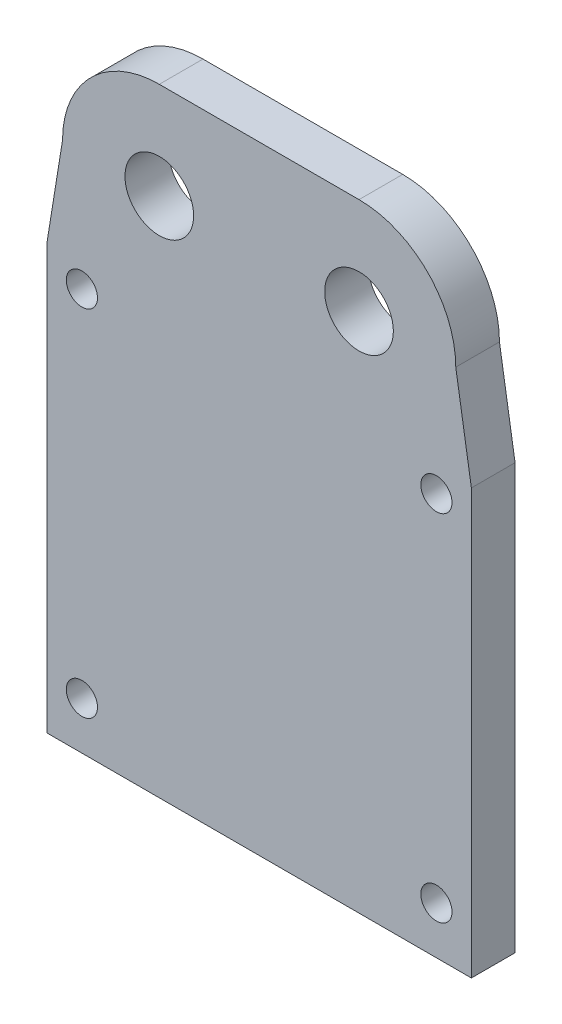
ISO-10303-21;
HEADER;
FILE_DESCRIPTION(('STEP AP214'),'2;1');
FILE_NAME('part.step','',(''),(''),'','','');
FILE_SCHEMA(('AUTOMOTIVE_DESIGN { 1 0 10303 214 1 1 1 1 }'));
ENDSEC;
DATA;
#1=APPLICATION_CONTEXT('core data for automotive mechanical design processes');
#2=APPLICATION_PROTOCOL_DEFINITION('international standard','automotive_design',2000,#1);
#3=PRODUCT_CONTEXT('',#1,'mechanical');
#4=PRODUCT('Part','Part','',(#3));
#5=PRODUCT_RELATED_PRODUCT_CATEGORY('part','',(#4));
#6=PRODUCT_DEFINITION_FORMATION('','',#4);
#7=PRODUCT_DEFINITION_CONTEXT('part definition',#1,'design');
#8=PRODUCT_DEFINITION('design','',#6,#7);
#9=PRODUCT_DEFINITION_SHAPE('','',#8);
#10=(LENGTH_UNIT() NAMED_UNIT(*) SI_UNIT(.MILLI.,.METRE.));
#11=(NAMED_UNIT(*) PLANE_ANGLE_UNIT() SI_UNIT($,.RADIAN.));
#12=(NAMED_UNIT(*) SI_UNIT($,.STERADIAN.) SOLID_ANGLE_UNIT());
#13=UNCERTAINTY_MEASURE_WITH_UNIT(LENGTH_MEASURE(1.E-05),#10,'distance_accuracy_value','');
#14=(GEOMETRIC_REPRESENTATION_CONTEXT(3) GLOBAL_UNCERTAINTY_ASSIGNED_CONTEXT((#13)) GLOBAL_UNIT_ASSIGNED_CONTEXT((#10,
#11,#12)) REPRESENTATION_CONTEXT('',''));
#15=CARTESIAN_POINT('',(0.,0.,0.));
#16=DIRECTION('',(0.,0.,1.));
#17=DIRECTION('',(1.,0.,0.));
#18=AXIS2_PLACEMENT_3D('',#15,#16,#17);
#19=CARTESIAN_POINT('',(8.,0.,10.));
#20=DIRECTION('',(0.,0.,-1.));
#21=DIRECTION('',(-1.,0.,0.));
#22=AXIS2_PLACEMENT_3D('',#19,#20,#21);
#23=CYLINDRICAL_SURFACE('',#22,7.75);
#24=CARTESIAN_POINT('',(8.,0.,3.5));
#25=DIRECTION('',(0.,0.,1.));
#26=DIRECTION('',(1.,0.,0.));
#27=AXIS2_PLACEMENT_3D('',#24,#25,#26);
#28=CIRCLE('',#27,7.75);
#29=CARTESIAN_POINT('',(15.75,0.,3.5));
#30=VERTEX_POINT('',#29);
#31=CARTESIAN_POINT('',(8.,7.75,3.5));
#32=VERTEX_POINT('',#31);
#33=EDGE_CURVE('E112',#30,#32,#28,.T.);
#34=ORIENTED_EDGE('',*,*,#33,.F.);
#35=DIRECTION('',(0.,0.,-1.));
#36=VECTOR('',#35,1.);
#37=CARTESIAN_POINT('',(15.75,0.,10.));
#38=LINE('',#37,#36);
#39=CARTESIAN_POINT('',(15.75,0.,0.));
#40=VERTEX_POINT('',#39);
#41=EDGE_CURVE('E181',#30,#40,#38,.T.);
#42=ORIENTED_EDGE('',*,*,#41,.T.);
#43=CARTESIAN_POINT('',(8.,0.,0.));
#44=DIRECTION('',(0.,0.,1.));
#45=DIRECTION('',(1.,0.,0.));
#46=AXIS2_PLACEMENT_3D('',#43,#44,#45);
#47=CIRCLE('',#46,7.75);
#48=CARTESIAN_POINT('',(8.,7.75,0.));
#49=VERTEX_POINT('',#48);
#50=EDGE_CURVE('E198',#40,#49,#47,.T.);
#51=ORIENTED_EDGE('',*,*,#50,.T.);
#52=DIRECTION('',(0.,0.,-1.));
#53=VECTOR('',#52,1.);
#54=CARTESIAN_POINT('',(8.,7.75,10.));
#55=LINE('',#54,#53);
#56=EDGE_CURVE('E11',#32,#49,#55,.T.);
#57=ORIENTED_EDGE('',*,*,#56,.F.);
#58=EDGE_LOOP('',(#34,#42,#51,#57));
#59=FACE_BOUND('',#58,.T.);
#60=ADVANCED_FACE('F41',(#59),#23,.T.);
#61=CARTESIAN_POINT('',(-8.,0.,10.));
#62=DIRECTION('',(0.,0.,-1.));
#63=DIRECTION('',(-1.,0.,0.));
#64=AXIS2_PLACEMENT_3D('',#61,#62,#63);
#65=CYLINDRICAL_SURFACE('',#64,7.75);
#66=CARTESIAN_POINT('',(-8.,0.,3.5));
#67=DIRECTION('',(0.,0.,1.));
#68=DIRECTION('',(1.,0.,0.));
#69=AXIS2_PLACEMENT_3D('',#66,#67,#68);
#70=CIRCLE('',#69,7.75);
#71=CARTESIAN_POINT('',(-8.,7.75,3.5));
#72=VERTEX_POINT('',#71);
#73=CARTESIAN_POINT('',(-15.75,0.,3.5));
#74=VERTEX_POINT('',#73);
#75=EDGE_CURVE('E110',#72,#74,#70,.T.);
#76=ORIENTED_EDGE('',*,*,#75,.F.);
#77=DIRECTION('',(0.,0.,-1.));
#78=VECTOR('',#77,1.);
#79=CARTESIAN_POINT('',(-8.,7.75,10.));
#80=LINE('',#79,#78);
#81=CARTESIAN_POINT('',(-8.,7.75,0.));
#82=VERTEX_POINT('',#81);
#83=EDGE_CURVE('E50',#72,#82,#80,.T.);
#84=ORIENTED_EDGE('',*,*,#83,.T.);
#85=CARTESIAN_POINT('',(-8.,0.,0.));
#86=DIRECTION('',(0.,0.,1.));
#87=DIRECTION('',(1.,0.,0.));
#88=AXIS2_PLACEMENT_3D('',#85,#86,#87);
#89=CIRCLE('',#88,7.75);
#90=CARTESIAN_POINT('',(-15.75,0.,0.));
#91=VERTEX_POINT('',#90);
#92=EDGE_CURVE('E204',#82,#91,#89,.T.);
#93=ORIENTED_EDGE('',*,*,#92,.T.);
#94=DIRECTION('',(0.,0.,-1.));
#95=VECTOR('',#94,1.);
#96=CARTESIAN_POINT('',(-15.75,0.,10.));
#97=LINE('',#96,#95);
#98=EDGE_CURVE('E66',#74,#91,#97,.T.);
#99=ORIENTED_EDGE('',*,*,#98,.F.);
#100=EDGE_LOOP('',(#76,#84,#93,#99));
#101=FACE_BOUND('',#100,.T.);
#102=ADVANCED_FACE('F120',(#101),#65,.T.);
#103=CARTESIAN_POINT('',(0.,7.75,10.));
#104=DIRECTION('',(0.,1.,0.));
#105=DIRECTION('',(-1.,0.,0.));
#106=AXIS2_PLACEMENT_3D('',#103,#104,#105);
#107=PLANE('',#106);
#108=ORIENTED_EDGE('',*,*,#83,.F.);
#109=DIRECTION('',(1.,0.,0.));
#110=VECTOR('',#109,1.);
#111=CARTESIAN_POINT('',(0.,7.75,3.5));
#112=LINE('',#111,#110);
#113=EDGE_CURVE('E107',#72,#32,#112,.T.);
#114=ORIENTED_EDGE('',*,*,#113,.T.);
#115=ORIENTED_EDGE('',*,*,#56,.T.);
#116=DIRECTION('',(1.,0.,0.));
#117=VECTOR('',#116,1.);
#118=CARTESIAN_POINT('',(0.,7.75,0.));
#119=LINE('',#118,#117);
#120=EDGE_CURVE('E129',#82,#49,#119,.T.);
#121=ORIENTED_EDGE('',*,*,#120,.F.);
#122=EDGE_LOOP('',(#108,#114,#115,#121));
#123=FACE_BOUND('',#122,.T.);
#124=ADVANCED_FACE('F127',(#123),#107,.T.);
#125=CARTESIAN_POINT('',(8.,0.,10.));
#126=DIRECTION('',(0.,0.,-1.));
#127=DIRECTION('',(-1.,0.,0.));
#128=AXIS2_PLACEMENT_3D('',#125,#126,#127);
#129=CYLINDRICAL_SURFACE('',#128,2.75);
#130=CARTESIAN_POINT('',(8.,0.,0.));
#131=DIRECTION('',(0.,0.,1.));
#132=DIRECTION('',(1.,0.,0.));
#133=AXIS2_PLACEMENT_3D('',#130,#131,#132);
#134=CIRCLE('',#133,2.75);
#135=CARTESIAN_POINT('',(10.75,0.,0.));
#136=VERTEX_POINT('',#135);
#137=EDGE_CURVE('E135',#136,#136,#134,.T.);
#138=ORIENTED_EDGE('',*,*,#137,.F.);
#139=EDGE_LOOP('',(#138));
#140=FACE_BOUND('',#139,.T.);
#141=CARTESIAN_POINT('',(8.,0.,3.5));
#142=DIRECTION('',(0.,0.,1.));
#143=DIRECTION('',(1.,0.,0.));
#144=AXIS2_PLACEMENT_3D('',#141,#142,#143);
#145=CIRCLE('',#144,2.75);
#146=CARTESIAN_POINT('',(10.75,0.,3.5));
#147=VERTEX_POINT('',#146);
#148=EDGE_CURVE('E144',#147,#147,#145,.T.);
#149=ORIENTED_EDGE('',*,*,#148,.T.);
#150=EDGE_LOOP('',(#149));
#151=FACE_BOUND('',#150,.T.);
#152=ADVANCED_FACE('F213',(#140,#151),#129,.F.);
#153=CARTESIAN_POINT('',(-8.,0.,10.));
#154=DIRECTION('',(0.,0.,-1.));
#155=DIRECTION('',(-1.,0.,0.));
#156=AXIS2_PLACEMENT_3D('',#153,#154,#155);
#157=CYLINDRICAL_SURFACE('',#156,2.75);
#158=CARTESIAN_POINT('',(-8.,0.,0.));
#159=DIRECTION('',(0.,0.,1.));
#160=DIRECTION('',(1.,0.,0.));
#161=AXIS2_PLACEMENT_3D('',#158,#159,#160);
#162=CIRCLE('',#161,2.75);
#163=CARTESIAN_POINT('',(-5.25,0.,0.));
#164=VERTEX_POINT('',#163);
#165=EDGE_CURVE('E131',#164,#164,#162,.T.);
#166=ORIENTED_EDGE('',*,*,#165,.F.);
#167=EDGE_LOOP('',(#166));
#168=FACE_BOUND('',#167,.T.);
#169=CARTESIAN_POINT('',(-8.,0.,3.5));
#170=DIRECTION('',(0.,0.,1.));
#171=DIRECTION('',(1.,0.,0.));
#172=AXIS2_PLACEMENT_3D('',#169,#170,#171);
#173=CIRCLE('',#172,2.75);
#174=CARTESIAN_POINT('',(-5.25,0.,3.5));
#175=VERTEX_POINT('',#174);
#176=EDGE_CURVE('E123',#175,#175,#173,.T.);
#177=ORIENTED_EDGE('',*,*,#176,.T.);
#178=EDGE_LOOP('',(#177));
#179=FACE_BOUND('',#178,.T.);
#180=ADVANCED_FACE('F216',(#168,#179),#157,.F.);
#181=CARTESIAN_POINT('',(-15.3506592292089,2.47591277890467,10.));
#182=DIRECTION('',(0.987241120712647,-0.159232438824621,0.));
#183=DIRECTION('',(0.159232438824621,0.987241120712647,0.));
#184=AXIS2_PLACEMENT_3D('',#181,#182,#183);
#185=PLANE('',#184);
#186=DIRECTION('',(-0.159232438824621,-0.987241120712647,0.));
#187=VECTOR('',#186,1.);
#188=CARTESIAN_POINT('',(-15.3506592292089,2.47591277890467,3.5));
#189=LINE('',#188,#187);
#190=CARTESIAN_POINT('',(-17.,-7.75,3.5));
#191=VERTEX_POINT('',#190);
#192=EDGE_CURVE('E124',#74,#191,#189,.T.);
#193=ORIENTED_EDGE('',*,*,#192,.F.);
#194=ORIENTED_EDGE('',*,*,#98,.T.);
#195=DIRECTION('',(-0.159232438824621,-0.987241120712647,0.));
#196=VECTOR('',#195,1.);
#197=CARTESIAN_POINT('',(-15.3506592292089,2.47591277890467,0.));
#198=LINE('',#197,#196);
#199=CARTESIAN_POINT('',(-17.,-7.75,0.));
#200=VERTEX_POINT('',#199);
#201=EDGE_CURVE('E154',#91,#200,#198,.T.);
#202=ORIENTED_EDGE('',*,*,#201,.T.);
#203=DIRECTION('',(0.,0.,-1.));
#204=VECTOR('',#203,1.);
#205=CARTESIAN_POINT('',(-17.,-7.75,10.));
#206=LINE('',#205,#204);
#207=EDGE_CURVE('E193',#191,#200,#206,.T.);
#208=ORIENTED_EDGE('',*,*,#207,.F.);
#209=EDGE_LOOP('',(#193,#194,#202,#208));
#210=FACE_BOUND('',#209,.T.);
#211=ADVANCED_FACE('F296',(#210),#185,.F.);
#212=CARTESIAN_POINT('',(-17.,0.,10.));
#213=DIRECTION('',(1.,0.,0.));
#214=DIRECTION('',(0.,1.,0.));
#215=AXIS2_PLACEMENT_3D('',#212,#213,#214);
#216=PLANE('',#215);
#217=DIRECTION('',(0.,1.,0.));
#218=VECTOR('',#217,1.);
#219=CARTESIAN_POINT('',(-17.,-46.25,3.5));
#220=LINE('',#219,#218);
#221=CARTESIAN_POINT('',(-17.,-41.75,3.5));
#222=VERTEX_POINT('',#221);
#223=EDGE_CURVE('E117',#222,#191,#220,.T.);
#224=ORIENTED_EDGE('',*,*,#223,.T.);
#225=ORIENTED_EDGE('',*,*,#207,.T.);
#226=DIRECTION('',(0.,-1.,0.));
#227=VECTOR('',#226,1.);
#228=CARTESIAN_POINT('',(-17.,0.,0.));
#229=LINE('',#228,#227);
#230=CARTESIAN_POINT('',(-17.,-41.75,0.));
#231=VERTEX_POINT('',#230);
#232=EDGE_CURVE('E158',#200,#231,#229,.T.);
#233=ORIENTED_EDGE('',*,*,#232,.T.);
#234=DIRECTION('',(0.,0.,-1.));
#235=VECTOR('',#234,1.);
#236=CARTESIAN_POINT('',(-17.,-41.75,10.));
#237=LINE('',#236,#235);
#238=EDGE_CURVE('E190',#222,#231,#237,.T.);
#239=ORIENTED_EDGE('',*,*,#238,.F.);
#240=EDGE_LOOP('',(#224,#225,#233,#239));
#241=FACE_BOUND('',#240,.T.);
#242=ADVANCED_FACE('F295',(#241),#216,.F.);
#243=CARTESIAN_POINT('',(0.,-41.75,10.));
#244=DIRECTION('',(0.,1.,0.));
#245=DIRECTION('',(0.,0.,1.));
#246=AXIS2_PLACEMENT_3D('',#243,#244,#245);
#247=PLANE('',#246);
#248=DIRECTION('',(1.,0.,0.));
#249=VECTOR('',#248,1.);
#250=CARTESIAN_POINT('',(0.,-41.75,3.5));
#251=LINE('',#250,#249);
#252=CARTESIAN_POINT('',(17.,-41.75,3.5));
#253=VERTEX_POINT('',#252);
#254=EDGE_CURVE('E229',#222,#253,#251,.T.);
#255=ORIENTED_EDGE('',*,*,#254,.F.);
#256=ORIENTED_EDGE('',*,*,#238,.T.);
#257=DIRECTION('',(1.,0.,0.));
#258=VECTOR('',#257,1.);
#259=CARTESIAN_POINT('',(0.,-41.75,0.));
#260=LINE('',#259,#258);
#261=CARTESIAN_POINT('',(17.,-41.75,0.));
#262=VERTEX_POINT('',#261);
#263=EDGE_CURVE('E165',#231,#262,#260,.T.);
#264=ORIENTED_EDGE('',*,*,#263,.T.);
#265=DIRECTION('',(0.,0.,-1.));
#266=VECTOR('',#265,1.);
#267=CARTESIAN_POINT('',(17.,-41.75,10.));
#268=LINE('',#267,#266);
#269=EDGE_CURVE('E187',#253,#262,#268,.T.);
#270=ORIENTED_EDGE('',*,*,#269,.F.);
#271=EDGE_LOOP('',(#255,#256,#264,#270));
#272=FACE_BOUND('',#271,.T.);
#273=ADVANCED_FACE('F292',(#272),#247,.F.);
#274=CARTESIAN_POINT('',(17.,0.,10.));
#275=DIRECTION('',(1.,0.,0.));
#276=DIRECTION('',(0.,1.,0.));
#277=AXIS2_PLACEMENT_3D('',#274,#275,#276);
#278=PLANE('',#277);
#279=DIRECTION('',(0.,0.,-1.));
#280=VECTOR('',#279,1.);
#281=CARTESIAN_POINT('',(17.,-7.75,10.));
#282=LINE('',#281,#280);
#283=CARTESIAN_POINT('',(17.,-7.75,3.5));
#284=VERTEX_POINT('',#283);
#285=CARTESIAN_POINT('',(17.,-7.75,0.));
#286=VERTEX_POINT('',#285);
#287=EDGE_CURVE('E184',#284,#286,#282,.T.);
#288=ORIENTED_EDGE('',*,*,#287,.F.);
#289=DIRECTION('',(0.,1.,0.));
#290=VECTOR('',#289,1.);
#291=CARTESIAN_POINT('',(17.,-46.25,3.5));
#292=LINE('',#291,#290);
#293=EDGE_CURVE('E58',#253,#284,#292,.T.);
#294=ORIENTED_EDGE('',*,*,#293,.F.);
#295=ORIENTED_EDGE('',*,*,#269,.T.);
#296=DIRECTION('',(0.,-1.,0.));
#297=VECTOR('',#296,1.);
#298=CARTESIAN_POINT('',(17.,0.,0.));
#299=LINE('',#298,#297);
#300=EDGE_CURVE('E173',#286,#262,#299,.T.);
#301=ORIENTED_EDGE('',*,*,#300,.F.);
#302=EDGE_LOOP('',(#288,#294,#295,#301));
#303=FACE_BOUND('',#302,.T.);
#304=ADVANCED_FACE('F288',(#303),#278,.T.);
#305=CARTESIAN_POINT('',(15.3506592292089,2.47591277890467,10.));
#306=DIRECTION('',(-0.987241120712647,-0.159232438824621,0.));
#307=DIRECTION('',(0.159232438824621,-0.987241120712647,0.));
#308=AXIS2_PLACEMENT_3D('',#305,#306,#307);
#309=PLANE('',#308);
#310=DIRECTION('',(-0.159232438824621,0.987241120712647,0.));
#311=VECTOR('',#310,1.);
#312=CARTESIAN_POINT('',(15.3506592292089,2.47591277890467,3.5));
#313=LINE('',#312,#311);
#314=EDGE_CURVE('E234',#284,#30,#313,.T.);
#315=ORIENTED_EDGE('',*,*,#314,.F.);
#316=ORIENTED_EDGE('',*,*,#287,.T.);
#317=DIRECTION('',(-0.159232438824621,0.987241120712647,0.));
#318=VECTOR('',#317,1.);
#319=CARTESIAN_POINT('',(15.3506592292089,2.47591277890467,0.));
#320=LINE('',#319,#318);
#321=EDGE_CURVE('E177',#286,#40,#320,.T.);
#322=ORIENTED_EDGE('',*,*,#321,.T.);
#323=ORIENTED_EDGE('',*,*,#41,.F.);
#324=EDGE_LOOP('',(#315,#316,#322,#323));
#325=FACE_BOUND('',#324,.T.);
#326=ADVANCED_FACE('F281',(#325),#309,.F.);
#327=CARTESIAN_POINT('',(-14.2,-9.55,-9.00000000000001));
#328=DIRECTION('',(0.,0.,1.));
#329=DIRECTION('',(1.,0.,0.));
#330=AXIS2_PLACEMENT_3D('',#327,#328,#329);
#331=CYLINDRICAL_SURFACE('',#330,1.25);
#332=CARTESIAN_POINT('',(-14.2,-9.55,0.));
#333=DIRECTION('',(0.,0.,1.));
#334=DIRECTION('',(1.,0.,0.));
#335=AXIS2_PLACEMENT_3D('',#332,#333,#334);
#336=CIRCLE('',#335,1.25);
#337=CARTESIAN_POINT('',(-12.95,-9.55,0.));
#338=VERTEX_POINT('',#337);
#339=EDGE_CURVE('E139',#338,#338,#336,.T.);
#340=ORIENTED_EDGE('',*,*,#339,.F.);
#341=EDGE_LOOP('',(#340));
#342=FACE_BOUND('',#341,.T.);
#343=CARTESIAN_POINT('',(-14.2,-9.55,3.5));
#344=DIRECTION('',(0.,0.,1.));
#345=DIRECTION('',(1.,0.,0.));
#346=AXIS2_PLACEMENT_3D('',#343,#344,#345);
#347=CIRCLE('',#346,1.25);
#348=CARTESIAN_POINT('',(-12.95,-9.55,3.5));
#349=VERTEX_POINT('',#348);
#350=EDGE_CURVE('E237',#349,#349,#347,.F.);
#351=ORIENTED_EDGE('',*,*,#350,.F.);
#352=EDGE_LOOP('',(#351));
#353=FACE_BOUND('',#352,.T.);
#354=ADVANCED_FACE('F354',(#342,#353),#331,.F.);
#355=CARTESIAN_POINT('',(14.2,-9.55,-9.00000000000001));
#356=DIRECTION('',(0.,0.,1.));
#357=DIRECTION('',(1.,0.,0.));
#358=AXIS2_PLACEMENT_3D('',#355,#356,#357);
#359=CYLINDRICAL_SURFACE('',#358,1.25);
#360=CARTESIAN_POINT('',(14.2,-9.55,0.));
#361=DIRECTION('',(0.,0.,1.));
#362=DIRECTION('',(1.,0.,0.));
#363=AXIS2_PLACEMENT_3D('',#360,#361,#362);
#364=CIRCLE('',#363,1.25);
#365=CARTESIAN_POINT('',(15.45,-9.55,0.));
#366=VERTEX_POINT('',#365);
#367=EDGE_CURVE('E143',#366,#366,#364,.T.);
#368=ORIENTED_EDGE('',*,*,#367,.F.);
#369=EDGE_LOOP('',(#368));
#370=FACE_BOUND('',#369,.T.);
#371=CARTESIAN_POINT('',(14.2,-9.55,3.5));
#372=DIRECTION('',(0.,0.,1.));
#373=DIRECTION('',(1.,0.,0.));
#374=AXIS2_PLACEMENT_3D('',#371,#372,#373);
#375=CIRCLE('',#374,1.25);
#376=CARTESIAN_POINT('',(15.45,-9.55,3.5));
#377=VERTEX_POINT('',#376);
#378=EDGE_CURVE('E241',#377,#377,#375,.F.);
#379=ORIENTED_EDGE('',*,*,#378,.F.);
#380=EDGE_LOOP('',(#379));
#381=FACE_BOUND('',#380,.T.);
#382=ADVANCED_FACE('F268',(#370,#381),#359,.F.);
#383=CARTESIAN_POINT('',(14.2,-37.95,-9.00000000000001));
#384=DIRECTION('',(0.,0.,1.));
#385=DIRECTION('',(1.,0.,0.));
#386=AXIS2_PLACEMENT_3D('',#383,#384,#385);
#387=CYLINDRICAL_SURFACE('',#386,1.25);
#388=CARTESIAN_POINT('',(14.2,-37.95,0.));
#389=DIRECTION('',(0.,0.,1.));
#390=DIRECTION('',(1.,0.,0.));
#391=AXIS2_PLACEMENT_3D('',#388,#389,#390);
#392=CIRCLE('',#391,1.25);
#393=CARTESIAN_POINT('',(15.45,-37.95,0.));
#394=VERTEX_POINT('',#393);
#395=EDGE_CURVE('E148',#394,#394,#392,.T.);
#396=ORIENTED_EDGE('',*,*,#395,.F.);
#397=EDGE_LOOP('',(#396));
#398=FACE_BOUND('',#397,.T.);
#399=CARTESIAN_POINT('',(14.2,-37.95,3.5));
#400=DIRECTION('',(0.,0.,1.));
#401=DIRECTION('',(1.,0.,0.));
#402=AXIS2_PLACEMENT_3D('',#399,#400,#401);
#403=CIRCLE('',#402,1.25);
#404=CARTESIAN_POINT('',(15.45,-37.95,3.5));
#405=VERTEX_POINT('',#404);
#406=EDGE_CURVE('E245',#405,#405,#403,.F.);
#407=ORIENTED_EDGE('',*,*,#406,.F.);
#408=EDGE_LOOP('',(#407));
#409=FACE_BOUND('',#408,.T.);
#410=ADVANCED_FACE('F260',(#398,#409),#387,.F.);
#411=CARTESIAN_POINT('',(-14.2,-37.95,-9.00000000000001));
#412=DIRECTION('',(0.,0.,1.));
#413=DIRECTION('',(1.,0.,0.));
#414=AXIS2_PLACEMENT_3D('',#411,#412,#413);
#415=CYLINDRICAL_SURFACE('',#414,1.25);
#416=CARTESIAN_POINT('',(-14.2,-37.95,0.));
#417=DIRECTION('',(0.,0.,1.));
#418=DIRECTION('',(1.,0.,0.));
#419=AXIS2_PLACEMENT_3D('',#416,#417,#418);
#420=CIRCLE('',#419,1.25);
#421=CARTESIAN_POINT('',(-12.95,-37.95,0.));
#422=VERTEX_POINT('',#421);
#423=EDGE_CURVE('E151',#422,#422,#420,.T.);
#424=ORIENTED_EDGE('',*,*,#423,.F.);
#425=EDGE_LOOP('',(#424));
#426=FACE_BOUND('',#425,.T.);
#427=CARTESIAN_POINT('',(-14.2,-37.95,3.5));
#428=DIRECTION('',(0.,0.,1.));
#429=DIRECTION('',(1.,0.,0.));
#430=AXIS2_PLACEMENT_3D('',#427,#428,#429);
#431=CIRCLE('',#430,1.25);
#432=CARTESIAN_POINT('',(-12.95,-37.95,3.5));
#433=VERTEX_POINT('',#432);
#434=EDGE_CURVE('E44',#433,#433,#431,.F.);
#435=ORIENTED_EDGE('',*,*,#434,.F.);
#436=EDGE_LOOP('',(#435));
#437=FACE_BOUND('',#436,.T.);
#438=ADVANCED_FACE('F258',(#426,#437),#415,.F.);
#439=CARTESIAN_POINT('',(0.,0.,0.));
#440=DIRECTION('',(0.,0.,1.));
#441=DIRECTION('',(1.,0.,0.));
#442=AXIS2_PLACEMENT_3D('',#439,#440,#441);
#443=PLANE('',#442);
#444=ORIENTED_EDGE('',*,*,#423,.T.);
#445=EDGE_LOOP('',(#444));
#446=FACE_BOUND('',#445,.T.);
#447=ORIENTED_EDGE('',*,*,#395,.T.);
#448=EDGE_LOOP('',(#447));
#449=FACE_BOUND('',#448,.T.);
#450=ORIENTED_EDGE('',*,*,#367,.T.);
#451=EDGE_LOOP('',(#450));
#452=FACE_BOUND('',#451,.T.);
#453=ORIENTED_EDGE('',*,*,#339,.T.);
#454=EDGE_LOOP('',(#453));
#455=FACE_BOUND('',#454,.T.);
#456=ORIENTED_EDGE('',*,*,#201,.F.);
#457=ORIENTED_EDGE('',*,*,#92,.F.);
#458=ORIENTED_EDGE('',*,*,#120,.T.);
#459=ORIENTED_EDGE('',*,*,#50,.F.);
#460=ORIENTED_EDGE('',*,*,#321,.F.);
#461=ORIENTED_EDGE('',*,*,#300,.T.);
#462=ORIENTED_EDGE('',*,*,#263,.F.);
#463=ORIENTED_EDGE('',*,*,#232,.F.);
#464=EDGE_LOOP('',(#456,#457,#458,#459,#460,#461,#462,#463));
#465=FACE_BOUND('',#464,.T.);
#466=ORIENTED_EDGE('',*,*,#137,.T.);
#467=EDGE_LOOP('',(#466));
#468=FACE_BOUND('',#467,.T.);
#469=ORIENTED_EDGE('',*,*,#165,.T.);
#470=EDGE_LOOP('',(#469));
#471=FACE_BOUND('',#470,.T.);
#472=ADVANCED_FACE('F210',(#446,#449,#452,#455,#465,#468,#471),#443,.F.);
#473=CARTESIAN_POINT('',(0.,-46.25,3.5));
#474=DIRECTION('',(0.,0.,1.));
#475=DIRECTION('',(1.,0.,0.));
#476=AXIS2_PLACEMENT_3D('',#473,#474,#475);
#477=PLANE('',#476);
#478=ORIENTED_EDGE('',*,*,#148,.F.);
#479=EDGE_LOOP('',(#478));
#480=FACE_BOUND('',#479,.T.);
#481=ORIENTED_EDGE('',*,*,#176,.F.);
#482=EDGE_LOOP('',(#481));
#483=FACE_BOUND('',#482,.T.);
#484=ORIENTED_EDGE('',*,*,#350,.T.);
#485=EDGE_LOOP('',(#484));
#486=FACE_BOUND('',#485,.T.);
#487=ORIENTED_EDGE('',*,*,#378,.T.);
#488=EDGE_LOOP('',(#487));
#489=FACE_BOUND('',#488,.T.);
#490=ORIENTED_EDGE('',*,*,#406,.T.);
#491=EDGE_LOOP('',(#490));
#492=FACE_BOUND('',#491,.T.);
#493=ORIENTED_EDGE('',*,*,#434,.T.);
#494=EDGE_LOOP('',(#493));
#495=FACE_BOUND('',#494,.T.);
#496=ORIENTED_EDGE('',*,*,#75,.T.);
#497=ORIENTED_EDGE('',*,*,#192,.T.);
#498=ORIENTED_EDGE('',*,*,#223,.F.);
#499=ORIENTED_EDGE('',*,*,#254,.T.);
#500=ORIENTED_EDGE('',*,*,#293,.T.);
#501=ORIENTED_EDGE('',*,*,#314,.T.);
#502=ORIENTED_EDGE('',*,*,#33,.T.);
#503=ORIENTED_EDGE('',*,*,#113,.F.);
#504=EDGE_LOOP('',(#496,#497,#498,#499,#500,#501,#502,#503));
#505=FACE_BOUND('',#504,.T.);
#506=ADVANCED_FACE('F109',(#480,#483,#486,#489,#492,#495,#505),#477,.T.);
#507=CLOSED_SHELL('',(#60,#102,#124,#152,#180,#211,#242,#273,#304,#326,#354,#382,#410,#438,#472,#506));
#508=MANIFOLD_SOLID_BREP('B2',#507);
#509=ADVANCED_BREP_SHAPE_REPRESENTATION('',(#18,#508),#14);
#510=SHAPE_DEFINITION_REPRESENTATION(#9,#509);
ENDSEC;
END-ISO-10303-21;
